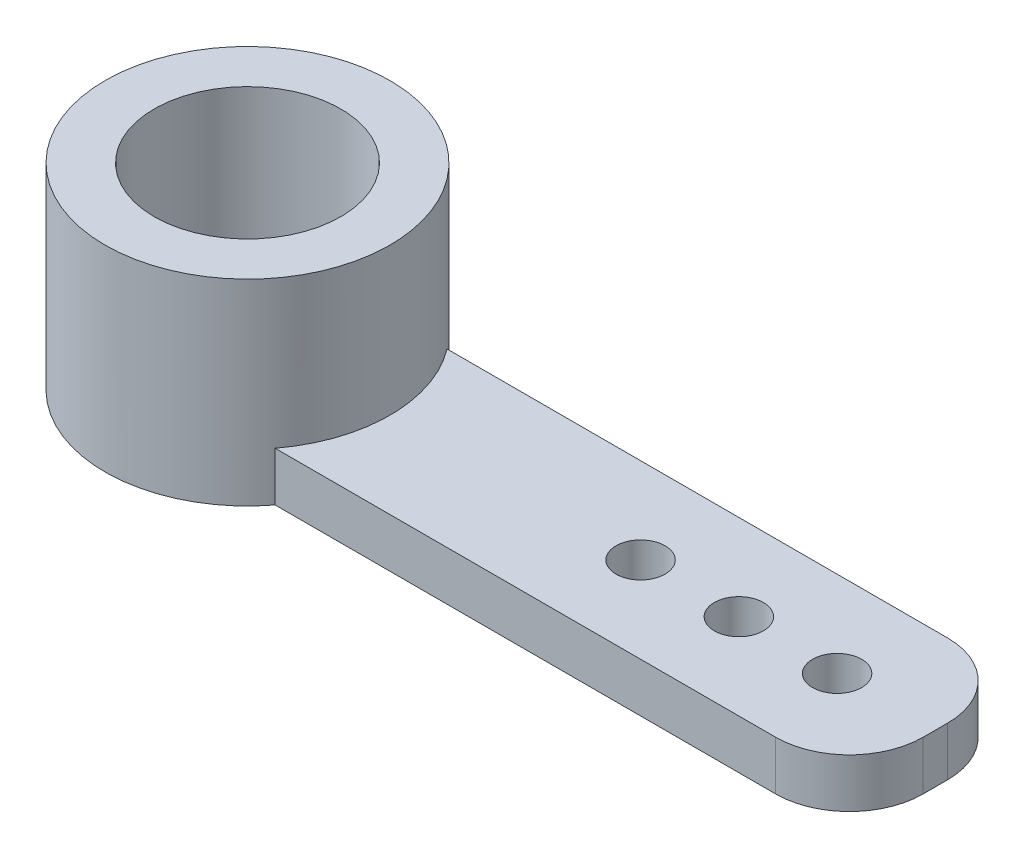
ISO-10303-21;
HEADER;
FILE_DESCRIPTION(('STEP AP214'),'2;1');
FILE_NAME('part.step','',(''),(''),'','','');
FILE_SCHEMA(('AUTOMOTIVE_DESIGN { 1 0 10303 214 1 1 1 1 }'));
ENDSEC;
DATA;
#1=APPLICATION_CONTEXT('core data for automotive mechanical design processes');
#2=APPLICATION_PROTOCOL_DEFINITION('international standard','automotive_design',2000,#1);
#3=PRODUCT_CONTEXT('',#1,'mechanical');
#4=PRODUCT('Part','Part','',(#3));
#5=PRODUCT_RELATED_PRODUCT_CATEGORY('part','',(#4));
#6=PRODUCT_DEFINITION_FORMATION('','',#4);
#7=PRODUCT_DEFINITION_CONTEXT('part definition',#1,'design');
#8=PRODUCT_DEFINITION('design','',#6,#7);
#9=PRODUCT_DEFINITION_SHAPE('','',#8);
#10=(LENGTH_UNIT() NAMED_UNIT(*) SI_UNIT(.MILLI.,.METRE.));
#11=(NAMED_UNIT(*) PLANE_ANGLE_UNIT() SI_UNIT($,.RADIAN.));
#12=(NAMED_UNIT(*) SI_UNIT($,.STERADIAN.) SOLID_ANGLE_UNIT());
#13=UNCERTAINTY_MEASURE_WITH_UNIT(LENGTH_MEASURE(1.E-05),#10,'distance_accuracy_value','');
#14=(GEOMETRIC_REPRESENTATION_CONTEXT(3) GLOBAL_UNCERTAINTY_ASSIGNED_CONTEXT((#13)) GLOBAL_UNIT_ASSIGNED_CONTEXT((#10,
#11,#12)) REPRESENTATION_CONTEXT('',''));
#15=CARTESIAN_POINT('',(0.,0.,0.));
#16=DIRECTION('',(0.,0.,1.));
#17=DIRECTION('',(1.,0.,0.));
#18=AXIS2_PLACEMENT_3D('',#15,#16,#17);
#19=CARTESIAN_POINT('',(0.,4.,0.));
#20=DIRECTION('',(0.,-1.,0.));
#21=DIRECTION('',(0.,0.,-1.));
#22=AXIS2_PLACEMENT_3D('',#19,#20,#21);
#23=CYLINDRICAL_SURFACE('',#22,1.);
#24=CARTESIAN_POINT('',(0.,0.,0.));
#25=DIRECTION('',(0.,1.,0.));
#26=DIRECTION('',(0.,0.,1.));
#27=AXIS2_PLACEMENT_3D('',#24,#25,#26);
#28=CIRCLE('',#27,1.);
#29=CARTESIAN_POINT('',(0.,0.,1.));
#30=VERTEX_POINT('',#29);
#31=EDGE_CURVE('E192',#30,#30,#28,.T.);
#32=ORIENTED_EDGE('',*,*,#31,.F.);
#33=EDGE_LOOP('',(#32));
#34=FACE_BOUND('',#33,.T.);
#35=CARTESIAN_POINT('',(0.,1.,0.));
#36=DIRECTION('',(0.,1.,0.));
#37=DIRECTION('',(0.,0.,1.));
#38=AXIS2_PLACEMENT_3D('',#35,#36,#37);
#39=CIRCLE('',#38,1.);
#40=CARTESIAN_POINT('',(0.,1.,1.));
#41=VERTEX_POINT('',#40);
#42=EDGE_CURVE('E43',#41,#41,#39,.T.);
#43=ORIENTED_EDGE('',*,*,#42,.T.);
#44=EDGE_LOOP('',(#43));
#45=FACE_BOUND('',#44,.T.);
#46=ADVANCED_FACE('F39',(#34,#45),#23,.F.);
#47=CARTESIAN_POINT('',(0.,4.,0.));
#48=DIRECTION('',(0.,-1.,0.));
#49=DIRECTION('',(0.,0.,-1.));
#50=AXIS2_PLACEMENT_3D('',#47,#48,#49);
#51=CYLINDRICAL_SURFACE('',#50,2.9);
#52=CARTESIAN_POINT('',(0.,4.,0.));
#53=DIRECTION('',(0.,1.,0.));
#54=DIRECTION('',(0.,0.,1.));
#55=AXIS2_PLACEMENT_3D('',#52,#53,#54);
#56=CIRCLE('',#55,2.9);
#57=CARTESIAN_POINT('',(0.,4.,2.9));
#58=VERTEX_POINT('',#57);
#59=EDGE_CURVE('E116',#58,#58,#56,.T.);
#60=ORIENTED_EDGE('',*,*,#59,.F.);
#61=EDGE_LOOP('',(#60));
#62=FACE_BOUND('',#61,.T.);
#63=DIRECTION('',(0.,-1.,0.));
#64=VECTOR('',#63,1.);
#65=CARTESIAN_POINT('',(2.31246621596944,4.,1.75));
#66=LINE('',#65,#64);
#67=CARTESIAN_POINT('',(2.31246621596944,1.,1.75));
#68=VERTEX_POINT('',#67);
#69=CARTESIAN_POINT('',(2.31246621596944,0.,1.75));
#70=VERTEX_POINT('',#69);
#71=EDGE_CURVE('E117',#68,#70,#66,.T.);
#72=ORIENTED_EDGE('',*,*,#71,.F.);
#73=CARTESIAN_POINT('',(0.,1.,0.));
#74=DIRECTION('',(0.,1.,0.));
#75=DIRECTION('',(0.,0.,1.));
#76=AXIS2_PLACEMENT_3D('',#73,#74,#75);
#77=CIRCLE('',#76,2.9);
#78=CARTESIAN_POINT('',(2.31246621596944,1.,-1.75));
#79=VERTEX_POINT('',#78);
#80=EDGE_CURVE('E122',#68,#79,#77,.T.);
#81=ORIENTED_EDGE('',*,*,#80,.T.);
#82=DIRECTION('',(0.,-1.,0.));
#83=VECTOR('',#82,1.);
#84=CARTESIAN_POINT('',(2.31246621596944,4.,-1.75));
#85=LINE('',#84,#83);
#86=CARTESIAN_POINT('',(2.31246621596944,0.,-1.75));
#87=VERTEX_POINT('',#86);
#88=EDGE_CURVE('E101',#87,#79,#85,.F.);
#89=ORIENTED_EDGE('',*,*,#88,.F.);
#90=CARTESIAN_POINT('',(0.,0.,0.));
#91=DIRECTION('',(0.,1.,0.));
#92=DIRECTION('',(0.,0.,1.));
#93=AXIS2_PLACEMENT_3D('',#90,#91,#92);
#94=CIRCLE('',#93,2.9);
#95=EDGE_CURVE('E109',#87,#70,#94,.T.);
#96=ORIENTED_EDGE('',*,*,#95,.T.);
#97=EDGE_LOOP('',(#72,#81,#89,#96));
#98=FACE_BOUND('',#97,.T.);
#99=ADVANCED_FACE('F120',(#62,#98),#51,.T.);
#100=CARTESIAN_POINT('',(0.,4.,0.));
#101=DIRECTION('',(0.,1.,0.));
#102=DIRECTION('',(0.,0.,1.));
#103=AXIS2_PLACEMENT_3D('',#100,#101,#102);
#104=PLANE('',#103);
#105=CARTESIAN_POINT('',(0.,4.,0.));
#106=DIRECTION('',(0.,1.,0.));
#107=DIRECTION('',(0.,0.,1.));
#108=AXIS2_PLACEMENT_3D('',#105,#106,#107);
#109=CIRCLE('',#108,1.9);
#110=CARTESIAN_POINT('',(0.,4.,1.9));
#111=VERTEX_POINT('',#110);
#112=EDGE_CURVE('E203',#111,#111,#109,.T.);
#113=ORIENTED_EDGE('',*,*,#112,.F.);
#114=EDGE_LOOP('',(#113));
#115=FACE_BOUND('',#114,.T.);
#116=ORIENTED_EDGE('',*,*,#59,.T.);
#117=EDGE_LOOP('',(#116));
#118=FACE_BOUND('',#117,.T.);
#119=ADVANCED_FACE('F232',(#115,#118),#104,.T.);
#120=CARTESIAN_POINT('',(0.,0.,0.));
#121=DIRECTION('',(0.,1.,0.));
#122=DIRECTION('',(0.,0.,1.));
#123=AXIS2_PLACEMENT_3D('',#120,#121,#122);
#124=PLANE('',#123);
#125=ORIENTED_EDGE('',*,*,#31,.T.);
#126=EDGE_LOOP('',(#125));
#127=FACE_BOUND('',#126,.T.);
#128=CARTESIAN_POINT('',(10.,0.,0.));
#129=DIRECTION('',(0.,1.,0.));
#130=DIRECTION('',(0.,0.,1.));
#131=AXIS2_PLACEMENT_3D('',#128,#129,#130);
#132=CIRCLE('',#131,0.500000000000001);
#133=CARTESIAN_POINT('',(10.,0.,0.500000000000001));
#134=VERTEX_POINT('',#133);
#135=EDGE_CURVE('E196',#134,#134,#132,.T.);
#136=ORIENTED_EDGE('',*,*,#135,.T.);
#137=EDGE_LOOP('',(#136));
#138=FACE_BOUND('',#137,.T.);
#139=CARTESIAN_POINT('',(12.,0.,0.));
#140=DIRECTION('',(0.,1.,0.));
#141=DIRECTION('',(0.,0.,1.));
#142=AXIS2_PLACEMENT_3D('',#139,#140,#141);
#143=CIRCLE('',#142,0.500000000000001);
#144=CARTESIAN_POINT('',(12.,0.,0.500000000000001));
#145=VERTEX_POINT('',#144);
#146=EDGE_CURVE('E191',#145,#145,#143,.T.);
#147=ORIENTED_EDGE('',*,*,#146,.T.);
#148=EDGE_LOOP('',(#147));
#149=FACE_BOUND('',#148,.T.);
#150=CARTESIAN_POINT('',(8.,0.,0.));
#151=DIRECTION('',(0.,1.,0.));
#152=DIRECTION('',(0.,0.,1.));
#153=AXIS2_PLACEMENT_3D('',#150,#151,#152);
#154=CIRCLE('',#153,0.500000000000001);
#155=CARTESIAN_POINT('',(8.,0.,0.500000000000001));
#156=VERTEX_POINT('',#155);
#157=EDGE_CURVE('E144',#156,#156,#154,.T.);
#158=ORIENTED_EDGE('',*,*,#157,.T.);
#159=EDGE_LOOP('',(#158));
#160=FACE_BOUND('',#159,.T.);
#161=DIRECTION('',(0.,0.,-1.));
#162=VECTOR('',#161,1.);
#163=CARTESIAN_POINT('',(14.,0.,1.75));
#164=LINE('',#163,#162);
#165=CARTESIAN_POINT('',(14.,0.,0.25));
#166=VERTEX_POINT('',#165);
#167=CARTESIAN_POINT('',(14.,0.,-0.25));
#168=VERTEX_POINT('',#167);
#169=EDGE_CURVE('E106',#166,#168,#164,.T.);
#170=ORIENTED_EDGE('',*,*,#169,.F.);
#171=CARTESIAN_POINT('',(12.5,0.,0.25));
#172=DIRECTION('',(0.,1.,0.));
#173=DIRECTION('',(0.,0.,1.));
#174=AXIS2_PLACEMENT_3D('',#171,#172,#173);
#175=CIRCLE('',#174,1.5);
#176=CARTESIAN_POINT('',(12.5,0.,1.75));
#177=VERTEX_POINT('',#176);
#178=EDGE_CURVE('E161',#166,#177,#175,.F.);
#179=ORIENTED_EDGE('',*,*,#178,.T.);
#180=DIRECTION('',(1.,0.,0.));
#181=VECTOR('',#180,1.);
#182=CARTESIAN_POINT('',(14.,0.,1.75));
#183=LINE('',#182,#181);
#184=EDGE_CURVE('E112',#70,#177,#183,.T.);
#185=ORIENTED_EDGE('',*,*,#184,.F.);
#186=ORIENTED_EDGE('',*,*,#95,.F.);
#187=DIRECTION('',(-1.,0.,0.));
#188=VECTOR('',#187,1.);
#189=CARTESIAN_POINT('',(14.,0.,-1.75));
#190=LINE('',#189,#188);
#191=CARTESIAN_POINT('',(12.5,0.,-1.75));
#192=VERTEX_POINT('',#191);
#193=EDGE_CURVE('E97',#192,#87,#190,.T.);
#194=ORIENTED_EDGE('',*,*,#193,.F.);
#195=CARTESIAN_POINT('',(12.5,0.,-0.25));
#196=DIRECTION('',(0.,1.,0.));
#197=DIRECTION('',(0.,0.,1.));
#198=AXIS2_PLACEMENT_3D('',#195,#196,#197);
#199=CIRCLE('',#198,1.5);
#200=EDGE_CURVE('E158',#192,#168,#199,.F.);
#201=ORIENTED_EDGE('',*,*,#200,.T.);
#202=EDGE_LOOP('',(#170,#179,#185,#186,#194,#201));
#203=FACE_BOUND('',#202,.T.);
#204=ADVANCED_FACE('F111',(#127,#138,#149,#160,#203),#124,.F.);
#205=CARTESIAN_POINT('',(14.,1.,1.75));
#206=DIRECTION('',(0.,0.,-1.));
#207=DIRECTION('',(-1.,0.,0.));
#208=AXIS2_PLACEMENT_3D('',#205,#206,#207);
#209=PLANE('',#208);
#210=ORIENTED_EDGE('',*,*,#184,.T.);
#211=DIRECTION('',(0.,-1.,0.));
#212=VECTOR('',#211,1.);
#213=CARTESIAN_POINT('',(12.5,1.,1.75));
#214=LINE('',#213,#212);
#215=CARTESIAN_POINT('',(12.5,1.,1.75));
#216=VERTEX_POINT('',#215);
#217=EDGE_CURVE('E64',#177,#216,#214,.F.);
#218=ORIENTED_EDGE('',*,*,#217,.T.);
#219=DIRECTION('',(1.,0.,0.));
#220=VECTOR('',#219,1.);
#221=CARTESIAN_POINT('',(14.,1.,1.75));
#222=LINE('',#221,#220);
#223=EDGE_CURVE('E105',#68,#216,#222,.T.);
#224=ORIENTED_EDGE('',*,*,#223,.F.);
#225=ORIENTED_EDGE('',*,*,#71,.T.);
#226=EDGE_LOOP('',(#210,#218,#224,#225));
#227=FACE_BOUND('',#226,.T.);
#228=ADVANCED_FACE('F181',(#227),#209,.F.);
#229=CARTESIAN_POINT('',(14.,1.,-1.75));
#230=DIRECTION('',(0.,0.,1.));
#231=DIRECTION('',(1.,0.,0.));
#232=AXIS2_PLACEMENT_3D('',#229,#230,#231);
#233=PLANE('',#232);
#234=DIRECTION('',(-1.,0.,0.));
#235=VECTOR('',#234,1.);
#236=CARTESIAN_POINT('',(14.,1.,-1.75));
#237=LINE('',#236,#235);
#238=CARTESIAN_POINT('',(12.5,1.,-1.75));
#239=VERTEX_POINT('',#238);
#240=EDGE_CURVE('E124',#239,#79,#237,.T.);
#241=ORIENTED_EDGE('',*,*,#240,.F.);
#242=DIRECTION('',(0.,-1.,0.));
#243=VECTOR('',#242,1.);
#244=CARTESIAN_POINT('',(12.5,1.,-1.75));
#245=LINE('',#244,#243);
#246=EDGE_CURVE('E11',#239,#192,#245,.T.);
#247=ORIENTED_EDGE('',*,*,#246,.T.);
#248=ORIENTED_EDGE('',*,*,#193,.T.);
#249=ORIENTED_EDGE('',*,*,#88,.T.);
#250=EDGE_LOOP('',(#241,#247,#248,#249));
#251=FACE_BOUND('',#250,.T.);
#252=ADVANCED_FACE('F99',(#251),#233,.F.);
#253=CARTESIAN_POINT('',(14.,1.,1.75));
#254=DIRECTION('',(-1.,0.,0.));
#255=DIRECTION('',(0.,0.,1.));
#256=AXIS2_PLACEMENT_3D('',#253,#254,#255);
#257=PLANE('',#256);
#258=DIRECTION('',(0.,0.,-1.));
#259=VECTOR('',#258,1.);
#260=CARTESIAN_POINT('',(14.,1.,1.75));
#261=LINE('',#260,#259);
#262=CARTESIAN_POINT('',(14.,1.,0.25));
#263=VERTEX_POINT('',#262);
#264=CARTESIAN_POINT('',(14.,1.,-0.25));
#265=VERTEX_POINT('',#264);
#266=EDGE_CURVE('E129',#263,#265,#261,.T.);
#267=ORIENTED_EDGE('',*,*,#266,.F.);
#268=DIRECTION('',(0.,-1.,0.));
#269=VECTOR('',#268,1.);
#270=CARTESIAN_POINT('',(14.,1.,0.25));
#271=LINE('',#270,#269);
#272=EDGE_CURVE('E154',#263,#166,#271,.T.);
#273=ORIENTED_EDGE('',*,*,#272,.T.);
#274=ORIENTED_EDGE('',*,*,#169,.T.);
#275=DIRECTION('',(0.,-1.,0.));
#276=VECTOR('',#275,1.);
#277=CARTESIAN_POINT('',(14.,1.,-0.25));
#278=LINE('',#277,#276);
#279=EDGE_CURVE('E138',#168,#265,#278,.F.);
#280=ORIENTED_EDGE('',*,*,#279,.T.);
#281=EDGE_LOOP('',(#267,#273,#274,#280));
#282=FACE_BOUND('',#281,.T.);
#283=ADVANCED_FACE('F175',(#282),#257,.F.);
#284=CARTESIAN_POINT('',(0.,1.,0.));
#285=DIRECTION('',(0.,1.,0.));
#286=DIRECTION('',(0.,0.,1.));
#287=AXIS2_PLACEMENT_3D('',#284,#285,#286);
#288=PLANE('',#287);
#289=CARTESIAN_POINT('',(10.,1.,0.));
#290=DIRECTION('',(0.,1.,0.));
#291=DIRECTION('',(0.,0.,1.));
#292=AXIS2_PLACEMENT_3D('',#289,#290,#291);
#293=CIRCLE('',#292,0.500000000000001);
#294=CARTESIAN_POINT('',(10.,1.,0.500000000000001));
#295=VERTEX_POINT('',#294);
#296=EDGE_CURVE('E148',#295,#295,#293,.F.);
#297=ORIENTED_EDGE('',*,*,#296,.T.);
#298=EDGE_LOOP('',(#297));
#299=FACE_BOUND('',#298,.T.);
#300=CARTESIAN_POINT('',(12.,1.,0.));
#301=DIRECTION('',(0.,1.,0.));
#302=DIRECTION('',(0.,0.,1.));
#303=AXIS2_PLACEMENT_3D('',#300,#301,#302);
#304=CIRCLE('',#303,0.500000000000001);
#305=CARTESIAN_POINT('',(12.,1.,0.500000000000001));
#306=VERTEX_POINT('',#305);
#307=EDGE_CURVE('E143',#306,#306,#304,.F.);
#308=ORIENTED_EDGE('',*,*,#307,.T.);
#309=EDGE_LOOP('',(#308));
#310=FACE_BOUND('',#309,.T.);
#311=CARTESIAN_POINT('',(8.,1.,0.));
#312=DIRECTION('',(0.,1.,0.));
#313=DIRECTION('',(0.,0.,1.));
#314=AXIS2_PLACEMENT_3D('',#311,#312,#313);
#315=CIRCLE('',#314,0.500000000000001);
#316=CARTESIAN_POINT('',(8.,1.,0.500000000000001));
#317=VERTEX_POINT('',#316);
#318=EDGE_CURVE('E139',#317,#317,#315,.F.);
#319=ORIENTED_EDGE('',*,*,#318,.T.);
#320=EDGE_LOOP('',(#319));
#321=FACE_BOUND('',#320,.T.);
#322=ORIENTED_EDGE('',*,*,#223,.T.);
#323=CARTESIAN_POINT('',(12.5,1.,0.25));
#324=DIRECTION('',(0.,1.,0.));
#325=DIRECTION('',(0.,0.,1.));
#326=AXIS2_PLACEMENT_3D('',#323,#324,#325);
#327=CIRCLE('',#326,1.5);
#328=EDGE_CURVE('E49',#216,#263,#327,.T.);
#329=ORIENTED_EDGE('',*,*,#328,.T.);
#330=ORIENTED_EDGE('',*,*,#266,.T.);
#331=CARTESIAN_POINT('',(12.5,1.,-0.25));
#332=DIRECTION('',(0.,1.,0.));
#333=DIRECTION('',(0.,0.,1.));
#334=AXIS2_PLACEMENT_3D('',#331,#332,#333);
#335=CIRCLE('',#334,1.5);
#336=EDGE_CURVE('E56',#265,#239,#335,.T.);
#337=ORIENTED_EDGE('',*,*,#336,.T.);
#338=ORIENTED_EDGE('',*,*,#240,.T.);
#339=ORIENTED_EDGE('',*,*,#80,.F.);
#340=EDGE_LOOP('',(#322,#329,#330,#337,#338,#339));
#341=FACE_BOUND('',#340,.T.);
#342=ADVANCED_FACE('F171',(#299,#310,#321,#341),#288,.T.);
#343=CARTESIAN_POINT('',(8.,4.,0.));
#344=DIRECTION('',(0.,-1.,0.));
#345=DIRECTION('',(0.,0.,-1.));
#346=AXIS2_PLACEMENT_3D('',#343,#344,#345);
#347=CYLINDRICAL_SURFACE('',#346,0.500000000000001);
#348=ORIENTED_EDGE('',*,*,#318,.F.);
#349=EDGE_LOOP('',(#348));
#350=FACE_BOUND('',#349,.T.);
#351=ORIENTED_EDGE('',*,*,#157,.F.);
#352=EDGE_LOOP('',(#351));
#353=FACE_BOUND('',#352,.T.);
#354=ADVANCED_FACE('F240',(#350,#353),#347,.F.);
#355=CARTESIAN_POINT('',(12.,4.,0.));
#356=DIRECTION('',(0.,-1.,0.));
#357=DIRECTION('',(0.,0.,-1.));
#358=AXIS2_PLACEMENT_3D('',#355,#356,#357);
#359=CYLINDRICAL_SURFACE('',#358,0.500000000000001);
#360=ORIENTED_EDGE('',*,*,#307,.F.);
#361=EDGE_LOOP('',(#360));
#362=FACE_BOUND('',#361,.T.);
#363=ORIENTED_EDGE('',*,*,#146,.F.);
#364=EDGE_LOOP('',(#363));
#365=FACE_BOUND('',#364,.T.);
#366=ADVANCED_FACE('F243',(#362,#365),#359,.F.);
#367=CARTESIAN_POINT('',(10.,4.,0.));
#368=DIRECTION('',(0.,-1.,0.));
#369=DIRECTION('',(0.,0.,-1.));
#370=AXIS2_PLACEMENT_3D('',#367,#368,#369);
#371=CYLINDRICAL_SURFACE('',#370,0.500000000000001);
#372=ORIENTED_EDGE('',*,*,#296,.F.);
#373=EDGE_LOOP('',(#372));
#374=FACE_BOUND('',#373,.T.);
#375=ORIENTED_EDGE('',*,*,#135,.F.);
#376=EDGE_LOOP('',(#375));
#377=FACE_BOUND('',#376,.T.);
#378=ADVANCED_FACE('F238',(#374,#377),#371,.F.);
#379=CARTESIAN_POINT('',(12.5,1.,0.25));
#380=DIRECTION('',(0.,-1.,0.));
#381=DIRECTION('',(0.,0.,-1.));
#382=AXIS2_PLACEMENT_3D('',#379,#380,#381);
#383=CYLINDRICAL_SURFACE('',#382,1.5);
#384=ORIENTED_EDGE('',*,*,#328,.F.);
#385=ORIENTED_EDGE('',*,*,#217,.F.);
#386=ORIENTED_EDGE('',*,*,#178,.F.);
#387=ORIENTED_EDGE('',*,*,#272,.F.);
#388=EDGE_LOOP('',(#384,#385,#386,#387));
#389=FACE_BOUND('',#388,.T.);
#390=ADVANCED_FACE('F180',(#389),#383,.T.);
#391=CARTESIAN_POINT('',(12.5,1.,-0.25));
#392=DIRECTION('',(0.,-1.,0.));
#393=DIRECTION('',(0.,0.,-1.));
#394=AXIS2_PLACEMENT_3D('',#391,#392,#393);
#395=CYLINDRICAL_SURFACE('',#394,1.5);
#396=ORIENTED_EDGE('',*,*,#336,.F.);
#397=ORIENTED_EDGE('',*,*,#279,.F.);
#398=ORIENTED_EDGE('',*,*,#200,.F.);
#399=ORIENTED_EDGE('',*,*,#246,.F.);
#400=EDGE_LOOP('',(#396,#397,#398,#399));
#401=FACE_BOUND('',#400,.T.);
#402=ADVANCED_FACE('F41',(#401),#395,.T.);
#403=CARTESIAN_POINT('',(0.,1.,0.));
#404=DIRECTION('',(0.,1.,0.));
#405=DIRECTION('',(0.,0.,1.));
#406=AXIS2_PLACEMENT_3D('',#403,#404,#405);
#407=CYLINDRICAL_SURFACE('',#406,1.9);
#408=CARTESIAN_POINT('',(0.,1.,0.));
#409=DIRECTION('',(0.,1.,0.));
#410=DIRECTION('',(0.,0.,1.));
#411=AXIS2_PLACEMENT_3D('',#408,#409,#410);
#412=CIRCLE('',#411,1.9);
#413=CARTESIAN_POINT('',(0.,1.,1.9));
#414=VERTEX_POINT('',#413);
#415=EDGE_CURVE('E207',#414,#414,#412,.T.);
#416=ORIENTED_EDGE('',*,*,#415,.F.);
#417=EDGE_LOOP('',(#416));
#418=FACE_BOUND('',#417,.T.);
#419=ORIENTED_EDGE('',*,*,#112,.T.);
#420=EDGE_LOOP('',(#419));
#421=FACE_BOUND('',#420,.T.);
#422=ADVANCED_FACE('F219',(#418,#421),#407,.F.);
#423=CARTESIAN_POINT('',(0.,1.,0.));
#424=DIRECTION('',(0.,1.,0.));
#425=DIRECTION('',(0.,0.,1.));
#426=AXIS2_PLACEMENT_3D('',#423,#424,#425);
#427=PLANE('',#426);
#428=ORIENTED_EDGE('',*,*,#42,.F.);
#429=EDGE_LOOP('',(#428));
#430=FACE_BOUND('',#429,.T.);
#431=ORIENTED_EDGE('',*,*,#415,.T.);
#432=EDGE_LOOP('',(#431));
#433=FACE_BOUND('',#432,.T.);
#434=ADVANCED_FACE('F217',(#430,#433),#427,.T.);
#435=CLOSED_SHELL('',(#46,#99,#119,#204,#228,#252,#283,#342,#354,#366,#378,#390,#402,#422,#434));
#436=MANIFOLD_SOLID_BREP('B2',#435);
#437=ADVANCED_BREP_SHAPE_REPRESENTATION('',(#18,#436),#14);
#438=SHAPE_DEFINITION_REPRESENTATION(#9,#437);
ENDSEC;
END-ISO-10303-21;
